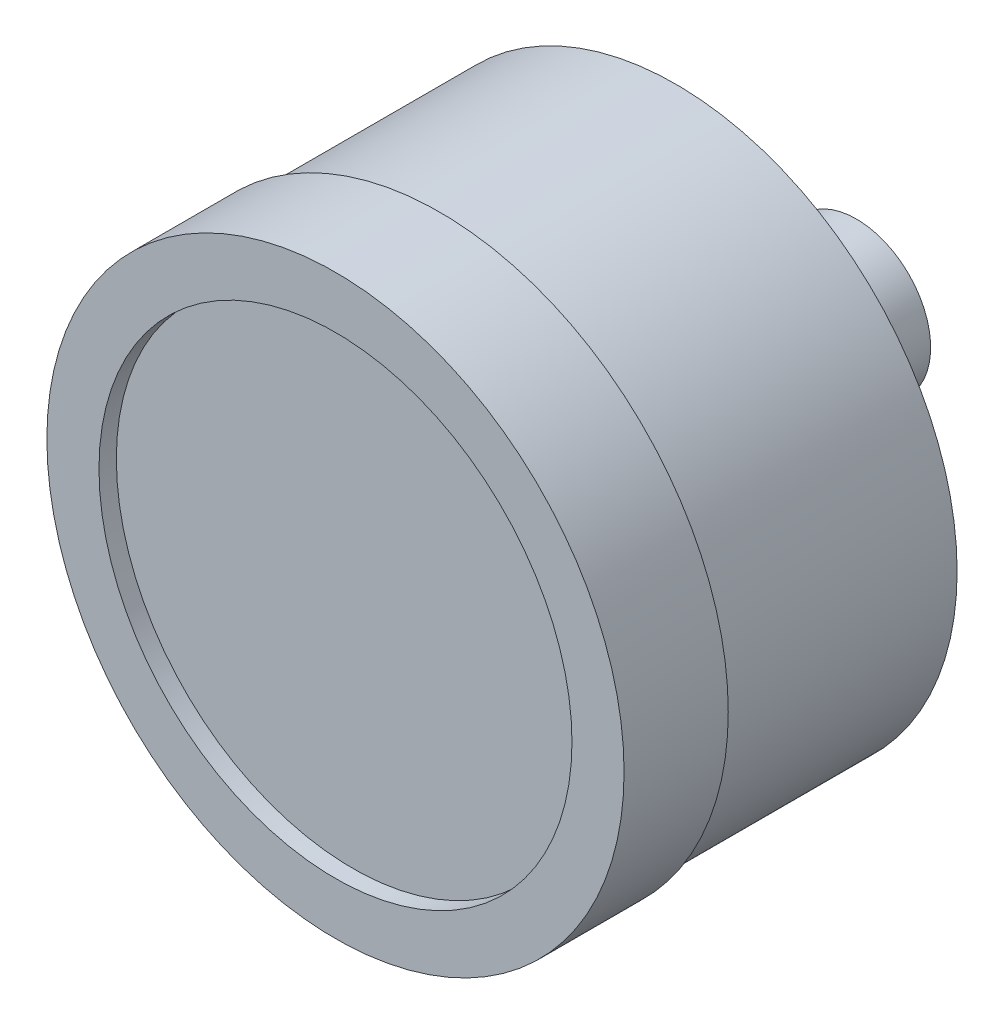
ISO-10303-21;
HEADER;
FILE_DESCRIPTION(('STEP AP214'),'2;1');
FILE_NAME('part.step','',(''),(''),'','','');
FILE_SCHEMA(('AUTOMOTIVE_DESIGN { 1 0 10303 214 1 1 1 1 }'));
ENDSEC;
DATA;
#1=APPLICATION_CONTEXT('core data for automotive mechanical design processes');
#2=APPLICATION_PROTOCOL_DEFINITION('international standard','automotive_design',2000,#1);
#3=PRODUCT_CONTEXT('',#1,'mechanical');
#4=PRODUCT('Part','Part','',(#3));
#5=PRODUCT_RELATED_PRODUCT_CATEGORY('part','',(#4));
#6=PRODUCT_DEFINITION_FORMATION('','',#4);
#7=PRODUCT_DEFINITION_CONTEXT('part definition',#1,'design');
#8=PRODUCT_DEFINITION('design','',#6,#7);
#9=PRODUCT_DEFINITION_SHAPE('','',#8);
#10=(LENGTH_UNIT() NAMED_UNIT(*) SI_UNIT(.MILLI.,.METRE.));
#11=(NAMED_UNIT(*) PLANE_ANGLE_UNIT() SI_UNIT($,.RADIAN.));
#12=(NAMED_UNIT(*) SI_UNIT($,.STERADIAN.) SOLID_ANGLE_UNIT());
#13=UNCERTAINTY_MEASURE_WITH_UNIT(LENGTH_MEASURE(1.E-05),#10,'distance_accuracy_value','');
#14=(GEOMETRIC_REPRESENTATION_CONTEXT(3) GLOBAL_UNCERTAINTY_ASSIGNED_CONTEXT((#13)) GLOBAL_UNIT_ASSIGNED_CONTEXT((#10,
#11,#12)) REPRESENTATION_CONTEXT('',''));
#15=CARTESIAN_POINT('',(0.,0.,0.));
#16=DIRECTION('',(0.,0.,1.));
#17=DIRECTION('',(1.,0.,0.));
#18=AXIS2_PLACEMENT_3D('',#15,#16,#17);
#19=CARTESIAN_POINT('',(0.,0.,-5.715));
#20=DIRECTION('',(0.,0.,1.));
#21=DIRECTION('',(1.,0.,0.));
#22=AXIS2_PLACEMENT_3D('',#19,#20,#21);
#23=PLANE('',#22);
#24=CARTESIAN_POINT('',(0.,0.,-5.715));
#25=DIRECTION('',(0.,0.,-1.));
#26=DIRECTION('',(-1.,0.,0.));
#27=AXIS2_PLACEMENT_3D('',#24,#25,#26);
#28=CIRCLE('',#27,5.42925);
#29=CARTESIAN_POINT('',(-5.42925,0.,-5.715));
#30=VERTEX_POINT('',#29);
#31=CARTESIAN_POINT('',(0.,5.42925,-5.715));
#32=VERTEX_POINT('',#31);
#33=EDGE_CURVE('E47',#30,#32,#28,.T.);
#34=ORIENTED_EDGE('',*,*,#33,.F.);
#35=DIRECTION('',(0.,1.,0.));
#36=VECTOR('',#35,1.);
#37=CARTESIAN_POINT('',(-5.42925,-5.42925,-5.715));
#38=LINE('',#37,#36);
#39=CARTESIAN_POINT('',(-5.42925,5.42925,-5.715));
#40=VERTEX_POINT('',#39);
#41=EDGE_CURVE('E98',#30,#40,#38,.T.);
#42=ORIENTED_EDGE('',*,*,#41,.T.);
#43=DIRECTION('',(1.,0.,0.));
#44=VECTOR('',#43,1.);
#45=CARTESIAN_POINT('',(5.42925,5.42925,-5.715));
#46=LINE('',#45,#44);
#47=EDGE_CURVE('E111',#40,#32,#46,.T.);
#48=ORIENTED_EDGE('',*,*,#47,.T.);
#49=EDGE_LOOP('',(#34,#42,#48));
#50=FACE_BOUND('',#49,.T.);
#51=ADVANCED_FACE('F36',(#50),#23,.F.);
#52=CARTESIAN_POINT('',(5.42925,0.,-5.715));
#53=VERTEX_POINT('',#52);
#54=EDGE_CURVE('E11',#32,#53,#28,.T.);
#55=ORIENTED_EDGE('',*,*,#54,.F.);
#56=CARTESIAN_POINT('',(5.42925,5.42925,-5.715));
#57=VERTEX_POINT('',#56);
#58=EDGE_CURVE('E97',#32,#57,#46,.T.);
#59=ORIENTED_EDGE('',*,*,#58,.T.);
#60=DIRECTION('',(0.,-1.,0.));
#61=VECTOR('',#60,1.);
#62=CARTESIAN_POINT('',(5.42925,-5.42925,-5.715));
#63=LINE('',#62,#61);
#64=EDGE_CURVE('E121',#57,#53,#63,.T.);
#65=ORIENTED_EDGE('',*,*,#64,.T.);
#66=EDGE_LOOP('',(#55,#59,#65));
#67=FACE_BOUND('',#66,.T.);
#68=ADVANCED_FACE('F177',(#67),#23,.F.);
#69=CARTESIAN_POINT('',(0.,-5.42925,-5.715));
#70=VERTEX_POINT('',#69);
#71=EDGE_CURVE('E45',#53,#70,#28,.T.);
#72=ORIENTED_EDGE('',*,*,#71,.F.);
#73=CARTESIAN_POINT('',(5.42925,-5.42925,-5.715));
#74=VERTEX_POINT('',#73);
#75=EDGE_CURVE('E120',#53,#74,#63,.T.);
#76=ORIENTED_EDGE('',*,*,#75,.T.);
#77=DIRECTION('',(-1.,0.,0.));
#78=VECTOR('',#77,1.);
#79=CARTESIAN_POINT('',(5.42925,-5.42925,-5.715));
#80=LINE('',#79,#78);
#81=EDGE_CURVE('E124',#74,#70,#80,.T.);
#82=ORIENTED_EDGE('',*,*,#81,.T.);
#83=EDGE_LOOP('',(#72,#76,#82));
#84=FACE_BOUND('',#83,.T.);
#85=ADVANCED_FACE('F164',(#84),#23,.F.);
#86=CARTESIAN_POINT('',(0.,0.,0.));
#87=DIRECTION('',(0.,0.,1.));
#88=DIRECTION('',(1.,0.,0.));
#89=AXIS2_PLACEMENT_3D('',#86,#87,#88);
#90=PLANE('',#89);
#91=CARTESIAN_POINT('',(0.,0.,0.));
#92=DIRECTION('',(0.,0.,1.));
#93=DIRECTION('',(1.,0.,0.));
#94=AXIS2_PLACEMENT_3D('',#91,#92,#93);
#95=CIRCLE('',#94,20.574);
#96=CARTESIAN_POINT('',(20.574,0.,0.));
#97=VERTEX_POINT('',#96);
#98=EDGE_CURVE('E116',#97,#97,#95,.T.);
#99=ORIENTED_EDGE('',*,*,#98,.F.);
#100=EDGE_LOOP('',(#99));
#101=FACE_BOUND('',#100,.T.);
#102=DIRECTION('',(0.,1.,0.));
#103=VECTOR('',#102,1.);
#104=CARTESIAN_POINT('',(-5.42925,-5.42925,0.));
#105=LINE('',#104,#103);
#106=CARTESIAN_POINT('',(-5.42925,-5.42925,0.));
#107=VERTEX_POINT('',#106);
#108=CARTESIAN_POINT('',(-5.42925,5.42925,0.));
#109=VERTEX_POINT('',#108);
#110=EDGE_CURVE('E127',#107,#109,#105,.T.);
#111=ORIENTED_EDGE('',*,*,#110,.F.);
#112=DIRECTION('',(-1.,0.,0.));
#113=VECTOR('',#112,1.);
#114=CARTESIAN_POINT('',(5.42925,-5.42925,0.));
#115=LINE('',#114,#113);
#116=CARTESIAN_POINT('',(5.42925,-5.42925,0.));
#117=VERTEX_POINT('',#116);
#118=EDGE_CURVE('E109',#117,#107,#115,.T.);
#119=ORIENTED_EDGE('',*,*,#118,.F.);
#120=DIRECTION('',(0.,-1.,0.));
#121=VECTOR('',#120,1.);
#122=CARTESIAN_POINT('',(5.42925,-5.42925,0.));
#123=LINE('',#122,#121);
#124=CARTESIAN_POINT('',(5.42925,5.42925,0.));
#125=VERTEX_POINT('',#124);
#126=EDGE_CURVE('E132',#125,#117,#123,.T.);
#127=ORIENTED_EDGE('',*,*,#126,.F.);
#128=DIRECTION('',(1.,0.,0.));
#129=VECTOR('',#128,1.);
#130=CARTESIAN_POINT('',(5.42925,5.42925,0.));
#131=LINE('',#130,#129);
#132=EDGE_CURVE('E129',#109,#125,#131,.T.);
#133=ORIENTED_EDGE('',*,*,#132,.F.);
#134=EDGE_LOOP('',(#111,#119,#127,#133));
#135=FACE_BOUND('',#134,.T.);
#136=ADVANCED_FACE('F161',(#101,#135),#90,.F.);
#137=CARTESIAN_POINT('',(0.,0.,24.892));
#138=DIRECTION('',(0.,0.,-1.));
#139=DIRECTION('',(-1.,0.,0.));
#140=AXIS2_PLACEMENT_3D('',#137,#138,#139);
#141=CYLINDRICAL_SURFACE('',#140,20.574);
#142=ORIENTED_EDGE('',*,*,#98,.T.);
#143=EDGE_LOOP('',(#142));
#144=FACE_BOUND('',#143,.T.);
#145=CARTESIAN_POINT('',(0.,0.,17.272));
#146=DIRECTION('',(0.,0.,1.));
#147=DIRECTION('',(1.,0.,0.));
#148=AXIS2_PLACEMENT_3D('',#145,#146,#147);
#149=CIRCLE('',#148,20.574);
#150=CARTESIAN_POINT('',(20.574,0.,17.272));
#151=VERTEX_POINT('',#150);
#152=EDGE_CURVE('E40',#151,#151,#149,.T.);
#153=ORIENTED_EDGE('',*,*,#152,.F.);
#154=EDGE_LOOP('',(#153));
#155=FACE_BOUND('',#154,.T.);
#156=ADVANCED_FACE('F38',(#144,#155),#141,.T.);
#157=CARTESIAN_POINT('',(0.,0.,17.272));
#158=DIRECTION('',(0.,0.,1.));
#159=DIRECTION('',(1.,0.,0.));
#160=AXIS2_PLACEMENT_3D('',#157,#158,#159);
#161=CYLINDRICAL_SURFACE('',#160,21.1074);
#162=CARTESIAN_POINT('',(0.,0.,17.272));
#163=DIRECTION('',(0.,0.,1.));
#164=DIRECTION('',(1.,0.,0.));
#165=AXIS2_PLACEMENT_3D('',#162,#163,#164);
#166=CIRCLE('',#165,21.1074);
#167=CARTESIAN_POINT('',(21.1074,0.,17.272));
#168=VERTEX_POINT('',#167);
#169=EDGE_CURVE('E152',#168,#168,#166,.T.);
#170=ORIENTED_EDGE('',*,*,#169,.T.);
#171=EDGE_LOOP('',(#170));
#172=FACE_BOUND('',#171,.T.);
#173=CARTESIAN_POINT('',(0.,0.,24.892));
#174=DIRECTION('',(0.,0.,1.));
#175=DIRECTION('',(1.,0.,0.));
#176=AXIS2_PLACEMENT_3D('',#173,#174,#175);
#177=CIRCLE('',#176,21.1074);
#178=CARTESIAN_POINT('',(21.1074,0.,24.892));
#179=VERTEX_POINT('',#178);
#180=EDGE_CURVE('E149',#179,#179,#177,.T.);
#181=ORIENTED_EDGE('',*,*,#180,.F.);
#182=EDGE_LOOP('',(#181));
#183=FACE_BOUND('',#182,.T.);
#184=ADVANCED_FACE('F208',(#172,#183),#161,.T.);
#185=CARTESIAN_POINT('',(0.,0.,17.272));
#186=DIRECTION('',(0.,0.,1.));
#187=DIRECTION('',(1.,0.,0.));
#188=AXIS2_PLACEMENT_3D('',#185,#186,#187);
#189=PLANE('',#188);
#190=ORIENTED_EDGE('',*,*,#152,.T.);
#191=EDGE_LOOP('',(#190));
#192=FACE_BOUND('',#191,.T.);
#193=ORIENTED_EDGE('',*,*,#169,.F.);
#194=EDGE_LOOP('',(#193));
#195=FACE_BOUND('',#194,.T.);
#196=ADVANCED_FACE('F205',(#192,#195),#189,.F.);
#197=CARTESIAN_POINT('',(0.,0.,24.892));
#198=DIRECTION('',(0.,0.,1.));
#199=DIRECTION('',(1.,0.,0.));
#200=AXIS2_PLACEMENT_3D('',#197,#198,#199);
#201=PLANE('',#200);
#202=CARTESIAN_POINT('',(0.,0.,24.892));
#203=DIRECTION('',(0.,0.,1.));
#204=DIRECTION('',(1.,0.,0.));
#205=AXIS2_PLACEMENT_3D('',#202,#203,#204);
#206=CIRCLE('',#205,17.2974);
#207=CARTESIAN_POINT('',(17.2974,0.,24.892));
#208=VERTEX_POINT('',#207);
#209=EDGE_CURVE('E145',#208,#208,#206,.T.);
#210=ORIENTED_EDGE('',*,*,#209,.F.);
#211=EDGE_LOOP('',(#210));
#212=FACE_BOUND('',#211,.T.);
#213=ORIENTED_EDGE('',*,*,#180,.T.);
#214=EDGE_LOOP('',(#213));
#215=FACE_BOUND('',#214,.T.);
#216=ADVANCED_FACE('F203',(#212,#215),#201,.T.);
#217=CARTESIAN_POINT('',(0.,0.,23.622));
#218=DIRECTION('',(0.,0.,1.));
#219=DIRECTION('',(1.,0.,0.));
#220=AXIS2_PLACEMENT_3D('',#217,#218,#219);
#221=CYLINDRICAL_SURFACE('',#220,17.2974);
#222=CARTESIAN_POINT('',(0.,0.,23.622));
#223=DIRECTION('',(0.,0.,1.));
#224=DIRECTION('',(1.,0.,0.));
#225=AXIS2_PLACEMENT_3D('',#222,#223,#224);
#226=CIRCLE('',#225,17.2974);
#227=CARTESIAN_POINT('',(17.2974,0.,23.622));
#228=VERTEX_POINT('',#227);
#229=EDGE_CURVE('E146',#228,#228,#226,.T.);
#230=ORIENTED_EDGE('',*,*,#229,.F.);
#231=EDGE_LOOP('',(#230));
#232=FACE_BOUND('',#231,.T.);
#233=ORIENTED_EDGE('',*,*,#209,.T.);
#234=EDGE_LOOP('',(#233));
#235=FACE_BOUND('',#234,.T.);
#236=ADVANCED_FACE('F199',(#232,#235),#221,.F.);
#237=CARTESIAN_POINT('',(0.,0.,23.622));
#238=DIRECTION('',(0.,0.,1.));
#239=DIRECTION('',(1.,0.,0.));
#240=AXIS2_PLACEMENT_3D('',#237,#238,#239);
#241=PLANE('',#240);
#242=ORIENTED_EDGE('',*,*,#229,.T.);
#243=EDGE_LOOP('',(#242));
#244=FACE_BOUND('',#243,.T.);
#245=ADVANCED_FACE('F196',(#244),#241,.T.);
#246=CARTESIAN_POINT('',(-5.42925,-5.42925,-5.715));
#247=DIRECTION('',(1.,0.,0.));
#248=DIRECTION('',(0.,0.,-1.));
#249=AXIS2_PLACEMENT_3D('',#246,#247,#248);
#250=PLANE('',#249);
#251=ORIENTED_EDGE('',*,*,#110,.T.);
#252=DIRECTION('',(0.,0.,1.));
#253=VECTOR('',#252,1.);
#254=CARTESIAN_POINT('',(-5.42925,5.42925,-5.715));
#255=LINE('',#254,#253);
#256=EDGE_CURVE('E105',#40,#109,#255,.T.);
#257=ORIENTED_EDGE('',*,*,#256,.F.);
#258=ORIENTED_EDGE('',*,*,#41,.F.);
#259=CARTESIAN_POINT('',(-5.42925,-5.42925,-5.715));
#260=VERTEX_POINT('',#259);
#261=EDGE_CURVE('E90',#260,#30,#38,.T.);
#262=ORIENTED_EDGE('',*,*,#261,.F.);
#263=DIRECTION('',(0.,0.,1.));
#264=VECTOR('',#263,1.);
#265=CARTESIAN_POINT('',(-5.42925,-5.42925,-5.715));
#266=LINE('',#265,#264);
#267=EDGE_CURVE('E126',#260,#107,#266,.T.);
#268=ORIENTED_EDGE('',*,*,#267,.T.);
#269=EDGE_LOOP('',(#251,#257,#258,#262,#268));
#270=FACE_BOUND('',#269,.T.);
#271=ADVANCED_FACE('F103',(#270),#250,.F.);
#272=CARTESIAN_POINT('',(5.42925,5.42925,-5.715));
#273=DIRECTION('',(0.,-1.,0.));
#274=DIRECTION('',(0.,0.,-1.));
#275=AXIS2_PLACEMENT_3D('',#272,#273,#274);
#276=PLANE('',#275);
#277=ORIENTED_EDGE('',*,*,#132,.T.);
#278=DIRECTION('',(0.,0.,1.));
#279=VECTOR('',#278,1.);
#280=CARTESIAN_POINT('',(5.42925,5.42925,-5.715));
#281=LINE('',#280,#279);
#282=EDGE_CURVE('E141',#57,#125,#281,.T.);
#283=ORIENTED_EDGE('',*,*,#282,.F.);
#284=ORIENTED_EDGE('',*,*,#58,.F.);
#285=ORIENTED_EDGE('',*,*,#47,.F.);
#286=ORIENTED_EDGE('',*,*,#256,.T.);
#287=EDGE_LOOP('',(#277,#283,#284,#285,#286));
#288=FACE_BOUND('',#287,.T.);
#289=ADVANCED_FACE('F174',(#288),#276,.F.);
#290=CARTESIAN_POINT('',(5.42925,-5.42925,-5.715));
#291=DIRECTION('',(-1.,0.,0.));
#292=DIRECTION('',(0.,0.,1.));
#293=AXIS2_PLACEMENT_3D('',#290,#291,#292);
#294=PLANE('',#293);
#295=ORIENTED_EDGE('',*,*,#126,.T.);
#296=DIRECTION('',(0.,0.,1.));
#297=VECTOR('',#296,1.);
#298=CARTESIAN_POINT('',(5.42925,-5.42925,-5.715));
#299=LINE('',#298,#297);
#300=EDGE_CURVE('E138',#74,#117,#299,.T.);
#301=ORIENTED_EDGE('',*,*,#300,.F.);
#302=ORIENTED_EDGE('',*,*,#75,.F.);
#303=ORIENTED_EDGE('',*,*,#64,.F.);
#304=ORIENTED_EDGE('',*,*,#282,.T.);
#305=EDGE_LOOP('',(#295,#301,#302,#303,#304));
#306=FACE_BOUND('',#305,.T.);
#307=ADVANCED_FACE('F170',(#306),#294,.F.);
#308=CARTESIAN_POINT('',(5.42925,-5.42925,-5.715));
#309=DIRECTION('',(0.,1.,0.));
#310=DIRECTION('',(0.,0.,1.));
#311=AXIS2_PLACEMENT_3D('',#308,#309,#310);
#312=PLANE('',#311);
#313=ORIENTED_EDGE('',*,*,#118,.T.);
#314=ORIENTED_EDGE('',*,*,#267,.F.);
#315=EDGE_CURVE('E93',#70,#260,#80,.T.);
#316=ORIENTED_EDGE('',*,*,#315,.F.);
#317=ORIENTED_EDGE('',*,*,#81,.F.);
#318=ORIENTED_EDGE('',*,*,#300,.T.);
#319=EDGE_LOOP('',(#313,#314,#316,#317,#318));
#320=FACE_BOUND('',#319,.T.);
#321=ADVANCED_FACE('F166',(#320),#312,.F.);
#322=EDGE_CURVE('E54',#70,#30,#28,.T.);
#323=ORIENTED_EDGE('',*,*,#322,.F.);
#324=ORIENTED_EDGE('',*,*,#315,.T.);
#325=ORIENTED_EDGE('',*,*,#261,.T.);
#326=EDGE_LOOP('',(#323,#324,#325));
#327=FACE_BOUND('',#326,.T.);
#328=ADVANCED_FACE('F92',(#327),#23,.F.);
#329=CARTESIAN_POINT('',(0.,0.,-13.208));
#330=DIRECTION('',(0.,0.,1.));
#331=DIRECTION('',(1.,0.,0.));
#332=AXIS2_PLACEMENT_3D('',#329,#330,#331);
#333=CYLINDRICAL_SURFACE('',#332,5.42925);
#334=CARTESIAN_POINT('',(0.,0.,-13.208));
#335=DIRECTION('',(0.,0.,-1.));
#336=DIRECTION('',(-1.,0.,0.));
#337=AXIS2_PLACEMENT_3D('',#334,#335,#336);
#338=CIRCLE('',#337,5.42925);
#339=CARTESIAN_POINT('',(-5.42925,0.,-13.208));
#340=VERTEX_POINT('',#339);
#341=EDGE_CURVE('E113',#340,#340,#338,.T.);
#342=ORIENTED_EDGE('',*,*,#341,.F.);
#343=EDGE_LOOP('',(#342));
#344=FACE_BOUND('',#343,.T.);
#345=ORIENTED_EDGE('',*,*,#33,.T.);
#346=ORIENTED_EDGE('',*,*,#54,.T.);
#347=ORIENTED_EDGE('',*,*,#71,.T.);
#348=ORIENTED_EDGE('',*,*,#322,.T.);
#349=EDGE_LOOP('',(#345,#346,#347,#348));
#350=FACE_BOUND('',#349,.T.);
#351=ADVANCED_FACE('F114',(#344,#350),#333,.T.);
#352=CARTESIAN_POINT('',(0.,0.,-13.208));
#353=DIRECTION('',(0.,0.,-1.));
#354=DIRECTION('',(-1.,0.,0.));
#355=AXIS2_PLACEMENT_3D('',#352,#353,#354);
#356=PLANE('',#355);
#357=ORIENTED_EDGE('',*,*,#341,.T.);
#358=EDGE_LOOP('',(#357));
#359=FACE_BOUND('',#358,.T.);
#360=ADVANCED_FACE('F260',(#359),#356,.T.);
#361=CLOSED_SHELL('',(#51,#68,#85,#136,#156,#184,#196,#216,#236,#245,#271,#289,#307,#321,#328,
#351,#360));
#362=MANIFOLD_SOLID_BREP('B2',#361);
#363=ADVANCED_BREP_SHAPE_REPRESENTATION('',(#18,#362),#14);
#364=SHAPE_DEFINITION_REPRESENTATION(#9,#363);
ENDSEC;
END-ISO-10303-21;
